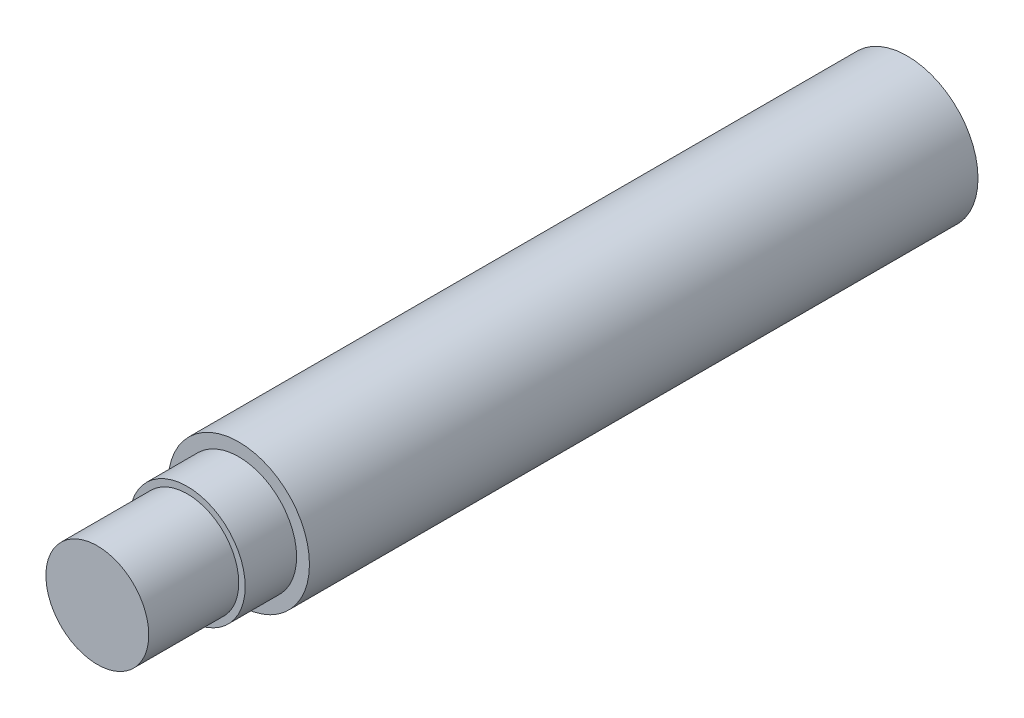
ISO-10303-21;
HEADER;
FILE_DESCRIPTION(('STEP AP214'),'2;1');
FILE_NAME('part.step','',(''),(''),'','','');
FILE_SCHEMA(('AUTOMOTIVE_DESIGN { 1 0 10303 214 1 1 1 1 }'));
ENDSEC;
DATA;
#1=APPLICATION_CONTEXT('core data for automotive mechanical design processes');
#2=APPLICATION_PROTOCOL_DEFINITION('international standard','automotive_design',2000,#1);
#3=PRODUCT_CONTEXT('',#1,'mechanical');
#4=PRODUCT('Part','Part','',(#3));
#5=PRODUCT_RELATED_PRODUCT_CATEGORY('part','',(#4));
#6=PRODUCT_DEFINITION_FORMATION('','',#4);
#7=PRODUCT_DEFINITION_CONTEXT('part definition',#1,'design');
#8=PRODUCT_DEFINITION('design','',#6,#7);
#9=PRODUCT_DEFINITION_SHAPE('','',#8);
#10=(LENGTH_UNIT() NAMED_UNIT(*) SI_UNIT(.MILLI.,.METRE.));
#11=(NAMED_UNIT(*) PLANE_ANGLE_UNIT() SI_UNIT($,.RADIAN.));
#12=(NAMED_UNIT(*) SI_UNIT($,.STERADIAN.) SOLID_ANGLE_UNIT());
#13=UNCERTAINTY_MEASURE_WITH_UNIT(LENGTH_MEASURE(1.E-05),#10,'distance_accuracy_value','');
#14=(GEOMETRIC_REPRESENTATION_CONTEXT(3) GLOBAL_UNCERTAINTY_ASSIGNED_CONTEXT((#13)) GLOBAL_UNIT_ASSIGNED_CONTEXT((#10,
#11,#12)) REPRESENTATION_CONTEXT('',''));
#15=CARTESIAN_POINT('',(0.,0.,0.));
#16=DIRECTION('',(0.,0.,1.));
#17=DIRECTION('',(1.,0.,0.));
#18=AXIS2_PLACEMENT_3D('',#15,#16,#17);
#19=CARTESIAN_POINT('',(0.,4.,0.));
#20=DIRECTION('',(0.,0.,-1.));
#21=DIRECTION('',(-1.,0.,0.));
#22=AXIS2_PLACEMENT_3D('',#19,#20,#21);
#23=PLANE('',#22);
#24=CARTESIAN_POINT('',(0.,0.,0.));
#25=DIRECTION('',(0.,0.,1.));
#26=DIRECTION('',(1.,0.,0.));
#27=AXIS2_PLACEMENT_3D('',#24,#25,#26);
#28=CIRCLE('',#27,4.);
#29=CARTESIAN_POINT('',(4.,0.,0.));
#30=VERTEX_POINT('',#29);
#31=EDGE_CURVE('E69',#30,#30,#28,.T.);
#32=ORIENTED_EDGE('',*,*,#31,.T.);
#33=EDGE_LOOP('',(#32));
#34=FACE_BOUND('',#33,.T.);
#35=ADVANCED_FACE('F33',(#34),#23,.F.);
#36=CARTESIAN_POINT('',(0.,2.5,-63.));
#37=DIRECTION('',(0.,0.,1.));
#38=DIRECTION('',(1.,0.,0.));
#39=AXIS2_PLACEMENT_3D('',#36,#37,#38);
#40=PLANE('',#39);
#41=CARTESIAN_POINT('',(0.,0.,-63.));
#42=DIRECTION('',(0.,0.,-1.));
#43=DIRECTION('',(-1.,0.,0.));
#44=AXIS2_PLACEMENT_3D('',#41,#42,#43);
#45=CIRCLE('',#44,3.5);
#46=CARTESIAN_POINT('',(-3.5,0.,-63.));
#47=VERTEX_POINT('',#46);
#48=EDGE_CURVE('E124',#47,#47,#45,.T.);
#49=ORIENTED_EDGE('',*,*,#48,.F.);
#50=EDGE_LOOP('',(#49));
#51=FACE_BOUND('',#50,.T.);
#52=CARTESIAN_POINT('',(0.,0.,-63.));
#53=DIRECTION('',(0.,0.,1.));
#54=DIRECTION('',(1.,0.,0.));
#55=AXIS2_PLACEMENT_3D('',#52,#53,#54);
#56=CIRCLE('',#55,5.5);
#57=CARTESIAN_POINT('',(5.5,0.,-63.));
#58=VERTEX_POINT('',#57);
#59=EDGE_CURVE('E40',#58,#58,#56,.T.);
#60=ORIENTED_EDGE('',*,*,#59,.F.);
#61=EDGE_LOOP('',(#60));
#62=FACE_BOUND('',#61,.T.);
#63=ADVANCED_FACE('F59',(#51,#62),#40,.F.);
#64=CARTESIAN_POINT('',(0.,0.,0.));
#65=DIRECTION('',(0.,0.,1.));
#66=DIRECTION('',(1.,0.,0.));
#67=AXIS2_PLACEMENT_3D('',#64,#65,#66);
#68=CYLINDRICAL_SURFACE('',#67,5.5);
#69=CARTESIAN_POINT('',(0.,0.,-11.));
#70=DIRECTION('',(0.,0.,1.));
#71=DIRECTION('',(1.,0.,0.));
#72=AXIS2_PLACEMENT_3D('',#69,#70,#71);
#73=CIRCLE('',#72,5.49999999999999);
#74=CARTESIAN_POINT('',(5.49999999999999,0.,-11.));
#75=VERTEX_POINT('',#74);
#76=EDGE_CURVE('E86',#75,#75,#73,.T.);
#77=ORIENTED_EDGE('',*,*,#76,.F.);
#78=EDGE_LOOP('',(#77));
#79=FACE_BOUND('',#78,.T.);
#80=ORIENTED_EDGE('',*,*,#59,.T.);
#81=EDGE_LOOP('',(#80));
#82=FACE_BOUND('',#81,.T.);
#83=ADVANCED_FACE('F64',(#79,#82),#68,.T.);
#84=CARTESIAN_POINT('',(0.,5.49999999999999,-11.));
#85=DIRECTION('',(0.,0.,-1.));
#86=DIRECTION('',(-1.,0.,0.));
#87=AXIS2_PLACEMENT_3D('',#84,#85,#86);
#88=PLANE('',#87);
#89=CARTESIAN_POINT('',(0.,0.,-11.));
#90=DIRECTION('',(0.,0.,1.));
#91=DIRECTION('',(1.,0.,0.));
#92=AXIS2_PLACEMENT_3D('',#89,#90,#91);
#93=CIRCLE('',#92,4.5);
#94=CARTESIAN_POINT('',(4.5,0.,-11.));
#95=VERTEX_POINT('',#94);
#96=EDGE_CURVE('E83',#95,#95,#93,.T.);
#97=ORIENTED_EDGE('',*,*,#96,.F.);
#98=EDGE_LOOP('',(#97));
#99=FACE_BOUND('',#98,.T.);
#100=ORIENTED_EDGE('',*,*,#76,.T.);
#101=EDGE_LOOP('',(#100));
#102=FACE_BOUND('',#101,.T.);
#103=ADVANCED_FACE('F94',(#99,#102),#88,.F.);
#104=CARTESIAN_POINT('',(0.,0.,0.));
#105=DIRECTION('',(0.,0.,1.));
#106=DIRECTION('',(1.,0.,0.));
#107=AXIS2_PLACEMENT_3D('',#104,#105,#106);
#108=CYLINDRICAL_SURFACE('',#107,4.5);
#109=CARTESIAN_POINT('',(0.,0.,-7.));
#110=DIRECTION('',(0.,0.,1.));
#111=DIRECTION('',(1.,0.,0.));
#112=AXIS2_PLACEMENT_3D('',#109,#110,#111);
#113=CIRCLE('',#112,4.5);
#114=CARTESIAN_POINT('',(4.5,0.,-7.));
#115=VERTEX_POINT('',#114);
#116=EDGE_CURVE('E74',#115,#115,#113,.T.);
#117=ORIENTED_EDGE('',*,*,#116,.F.);
#118=EDGE_LOOP('',(#117));
#119=FACE_BOUND('',#118,.T.);
#120=ORIENTED_EDGE('',*,*,#96,.T.);
#121=EDGE_LOOP('',(#120));
#122=FACE_BOUND('',#121,.T.);
#123=ADVANCED_FACE('F100',(#119,#122),#108,.T.);
#124=CARTESIAN_POINT('',(0.,4.5,-7.));
#125=DIRECTION('',(0.,0.,-1.));
#126=DIRECTION('',(-1.,0.,0.));
#127=AXIS2_PLACEMENT_3D('',#124,#125,#126);
#128=PLANE('',#127);
#129=CARTESIAN_POINT('',(0.,0.,-7.));
#130=DIRECTION('',(0.,0.,1.));
#131=DIRECTION('',(1.,0.,0.));
#132=AXIS2_PLACEMENT_3D('',#129,#130,#131);
#133=CIRCLE('',#132,4.);
#134=CARTESIAN_POINT('',(4.,0.,-7.));
#135=VERTEX_POINT('',#134);
#136=EDGE_CURVE('E71',#135,#135,#133,.T.);
#137=ORIENTED_EDGE('',*,*,#136,.F.);
#138=EDGE_LOOP('',(#137));
#139=FACE_BOUND('',#138,.T.);
#140=ORIENTED_EDGE('',*,*,#116,.T.);
#141=EDGE_LOOP('',(#140));
#142=FACE_BOUND('',#141,.T.);
#143=ADVANCED_FACE('F107',(#139,#142),#128,.F.);
#144=CARTESIAN_POINT('',(0.,0.,0.));
#145=DIRECTION('',(0.,0.,1.));
#146=DIRECTION('',(1.,0.,0.));
#147=AXIS2_PLACEMENT_3D('',#144,#145,#146);
#148=CYLINDRICAL_SURFACE('',#147,4.);
#149=ORIENTED_EDGE('',*,*,#31,.F.);
#150=EDGE_LOOP('',(#149));
#151=FACE_BOUND('',#150,.T.);
#152=ORIENTED_EDGE('',*,*,#136,.T.);
#153=EDGE_LOOP('',(#152));
#154=FACE_BOUND('',#153,.T.);
#155=ADVANCED_FACE('F111',(#151,#154),#148,.T.);
#156=CARTESIAN_POINT('',(0.,0.,-57.));
#157=DIRECTION('',(0.,0.,-1.));
#158=DIRECTION('',(-1.,0.,0.));
#159=AXIS2_PLACEMENT_3D('',#156,#157,#158);
#160=CONICAL_SURFACE('',#159,3.5,1.02974425867665);
#161=CARTESIAN_POINT('',(0.,0.,-57.));
#162=DIRECTION('',(0.,0.,-1.));
#163=DIRECTION('',(-1.,0.,0.));
#164=AXIS2_PLACEMENT_3D('',#161,#162,#163);
#165=CIRCLE('',#164,3.5);
#166=CARTESIAN_POINT('',(-3.5,0.,-57.));
#167=VERTEX_POINT('',#166);
#168=EDGE_CURVE('E77',#167,#167,#165,.T.);
#169=ORIENTED_EDGE('',*,*,#168,.T.);
#170=EDGE_LOOP('',(#169));
#171=FACE_BOUND('',#170,.T.);
#172=CARTESIAN_POINT('',(0.,0.,-56.3991393809724));
#173=DIRECTION('',(0.,0.,-1.));
#174=DIRECTION('',(-1.,0.,0.));
#175=AXIS2_PLACEMENT_3D('',#172,#173,#174);
#176=CIRCLE('',#175,2.5);
#177=CARTESIAN_POINT('',(-2.5,0.,-56.3991393809724));
#178=VERTEX_POINT('',#177);
#179=EDGE_CURVE('E36',#178,#178,#176,.T.);
#180=ORIENTED_EDGE('',*,*,#179,.F.);
#181=EDGE_LOOP('',(#180));
#182=FACE_BOUND('',#181,.T.);
#183=ADVANCED_FACE('F54',(#171,#182),#160,.F.);
#184=CARTESIAN_POINT('',(0.,0.,-63.));
#185=DIRECTION('',(0.,0.,-1.));
#186=DIRECTION('',(-1.,0.,0.));
#187=AXIS2_PLACEMENT_3D('',#184,#185,#186);
#188=CYLINDRICAL_SURFACE('',#187,3.5);
#189=ORIENTED_EDGE('',*,*,#168,.F.);
#190=EDGE_LOOP('',(#189));
#191=FACE_BOUND('',#190,.T.);
#192=ORIENTED_EDGE('',*,*,#48,.T.);
#193=EDGE_LOOP('',(#192));
#194=FACE_BOUND('',#193,.T.);
#195=ADVANCED_FACE('F46',(#191,#194),#188,.F.);
#196=CARTESIAN_POINT('',(0.,0.,-22.6707264208463));
#197=DIRECTION('',(0.,0.,-1.));
#198=DIRECTION('',(-1.,0.,0.));
#199=AXIS2_PLACEMENT_3D('',#196,#197,#198);
#200=CONICAL_SURFACE('',#199,0.,1.08210413623649);
#201=CARTESIAN_POINT('',(0.,0.,-24.));
#202=DIRECTION('',(0.,0.,1.));
#203=DIRECTION('',(1.,0.,0.));
#204=AXIS2_PLACEMENT_3D('',#201,#202,#203);
#205=CIRCLE('',#204,2.5);
#206=CARTESIAN_POINT('',(2.5,0.,-24.));
#207=VERTEX_POINT('',#206);
#208=EDGE_CURVE('E11',#207,#207,#205,.T.);
#209=ORIENTED_EDGE('',*,*,#208,.F.);
#210=EDGE_LOOP('',(#209));
#211=FACE_BOUND('',#210,.T.);
#212=CARTESIAN_POINT('',(0.,0.,-22.6707264208463));
#213=VERTEX_POINT('',#212);
#214=VERTEX_LOOP('',#213);
#215=FACE_BOUND('',#214,.T.);
#216=ADVANCED_FACE('F43',(#211,#215),#200,.F.);
#217=CARTESIAN_POINT('',(0.,0.,0.));
#218=DIRECTION('',(0.,0.,1.));
#219=DIRECTION('',(1.,0.,0.));
#220=AXIS2_PLACEMENT_3D('',#217,#218,#219);
#221=CYLINDRICAL_SURFACE('',#220,2.5);
#222=ORIENTED_EDGE('',*,*,#179,.T.);
#223=EDGE_LOOP('',(#222));
#224=FACE_BOUND('',#223,.T.);
#225=ORIENTED_EDGE('',*,*,#208,.T.);
#226=EDGE_LOOP('',(#225));
#227=FACE_BOUND('',#226,.T.);
#228=ADVANCED_FACE('F45',(#224,#227),#221,.F.);
#229=CLOSED_SHELL('',(#35,#63,#83,#103,#123,#143,#155,#183,#195,#216,#228));
#230=MANIFOLD_SOLID_BREP('B2',#229);
#231=ADVANCED_BREP_SHAPE_REPRESENTATION('',(#18,#230),#14);
#232=SHAPE_DEFINITION_REPRESENTATION(#9,#231);
ENDSEC;
END-ISO-10303-21;
